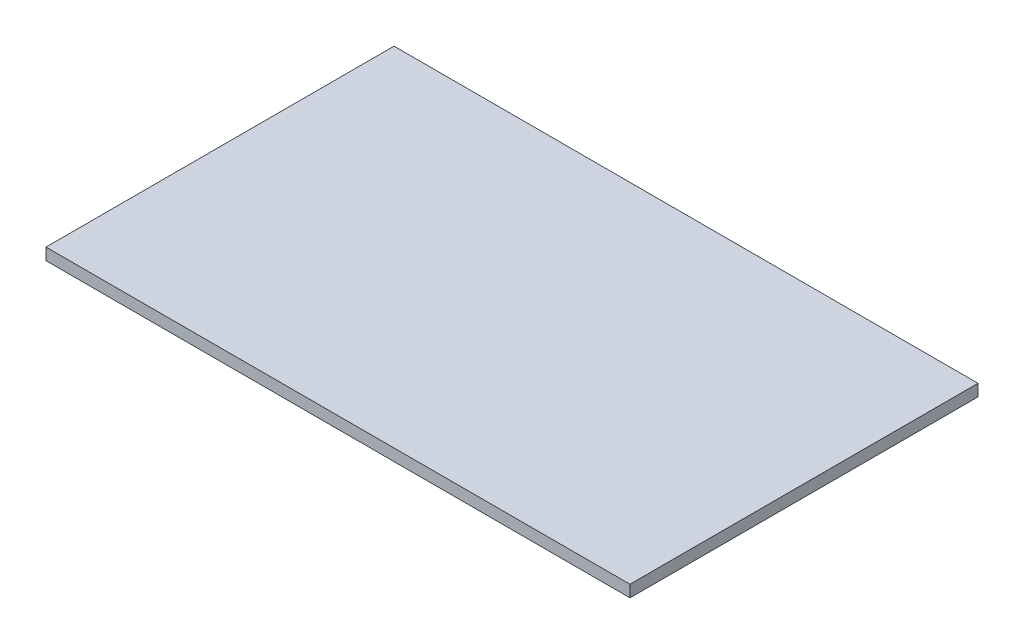
ISO-10303-21;
HEADER;
FILE_DESCRIPTION(('STEP AP214'),'2;1');
FILE_NAME('part.step','',(''),(''),'','','');
FILE_SCHEMA(('AUTOMOTIVE_DESIGN { 1 0 10303 214 1 1 1 1 }'));
ENDSEC;
DATA;
#1=APPLICATION_CONTEXT('core data for automotive mechanical design processes');
#2=APPLICATION_PROTOCOL_DEFINITION('international standard','automotive_design',2000,#1);
#3=PRODUCT_CONTEXT('',#1,'mechanical');
#4=PRODUCT('Part','Part','',(#3));
#5=PRODUCT_RELATED_PRODUCT_CATEGORY('part','',(#4));
#6=PRODUCT_DEFINITION_FORMATION('','',#4);
#7=PRODUCT_DEFINITION_CONTEXT('part definition',#1,'design');
#8=PRODUCT_DEFINITION('design','',#6,#7);
#9=PRODUCT_DEFINITION_SHAPE('','',#8);
#10=(LENGTH_UNIT() NAMED_UNIT(*) SI_UNIT(.MILLI.,.METRE.));
#11=(NAMED_UNIT(*) PLANE_ANGLE_UNIT() SI_UNIT($,.RADIAN.));
#12=(NAMED_UNIT(*) SI_UNIT($,.STERADIAN.) SOLID_ANGLE_UNIT());
#13=UNCERTAINTY_MEASURE_WITH_UNIT(LENGTH_MEASURE(1.E-05),#10,'distance_accuracy_value','');
#14=(GEOMETRIC_REPRESENTATION_CONTEXT(3) GLOBAL_UNCERTAINTY_ASSIGNED_CONTEXT((#13)) GLOBAL_UNIT_ASSIGNED_CONTEXT((#10,
#11,#12)) REPRESENTATION_CONTEXT('',''));
#15=CARTESIAN_POINT('',(0.,0.,0.));
#16=DIRECTION('',(0.,0.,1.));
#17=DIRECTION('',(1.,0.,0.));
#18=AXIS2_PLACEMENT_3D('',#15,#16,#17);
#19=CARTESIAN_POINT('',(247.5,10.,-147.5));
#20=DIRECTION('',(-1.,0.,0.));
#21=DIRECTION('',(0.,0.,1.));
#22=AXIS2_PLACEMENT_3D('',#19,#20,#21);
#23=PLANE('',#22);
#24=DIRECTION('',(0.,0.,-1.));
#25=VECTOR('',#24,1.);
#26=CARTESIAN_POINT('',(247.5,0.,-147.5));
#27=LINE('',#26,#25);
#28=CARTESIAN_POINT('',(247.5,0.,147.5));
#29=VERTEX_POINT('',#28);
#30=CARTESIAN_POINT('',(247.5,0.,-147.5));
#31=VERTEX_POINT('',#30);
#32=EDGE_CURVE('E95',#29,#31,#27,.T.);
#33=ORIENTED_EDGE('',*,*,#32,.T.);
#34=DIRECTION('',(0.,-1.,0.));
#35=VECTOR('',#34,1.);
#36=CARTESIAN_POINT('',(247.5,10.,-147.5));
#37=LINE('',#36,#35);
#38=CARTESIAN_POINT('',(247.5,10.,-147.5));
#39=VERTEX_POINT('',#38);
#40=EDGE_CURVE('E11',#39,#31,#37,.T.);
#41=ORIENTED_EDGE('',*,*,#40,.F.);
#42=DIRECTION('',(0.,0.,-1.));
#43=VECTOR('',#42,1.);
#44=CARTESIAN_POINT('',(247.5,10.,-147.5));
#45=LINE('',#44,#43);
#46=CARTESIAN_POINT('',(247.5,10.,147.5));
#47=VERTEX_POINT('',#46);
#48=EDGE_CURVE('E83',#47,#39,#45,.T.);
#49=ORIENTED_EDGE('',*,*,#48,.F.);
#50=DIRECTION('',(0.,-1.,0.));
#51=VECTOR('',#50,1.);
#52=CARTESIAN_POINT('',(247.5,10.,147.5));
#53=LINE('',#52,#51);
#54=EDGE_CURVE('E91',#47,#29,#53,.T.);
#55=ORIENTED_EDGE('',*,*,#54,.T.);
#56=EDGE_LOOP('',(#33,#41,#49,#55));
#57=FACE_BOUND('',#56,.T.);
#58=ADVANCED_FACE('F32',(#57),#23,.F.);
#59=CARTESIAN_POINT('',(-247.5,10.,-147.5));
#60=DIRECTION('',(0.,0.,1.));
#61=DIRECTION('',(1.,0.,0.));
#62=AXIS2_PLACEMENT_3D('',#59,#60,#61);
#63=PLANE('',#62);
#64=DIRECTION('',(-1.,0.,0.));
#65=VECTOR('',#64,1.);
#66=CARTESIAN_POINT('',(-247.5,0.,-147.5));
#67=LINE('',#66,#65);
#68=CARTESIAN_POINT('',(-247.5,0.,-147.5));
#69=VERTEX_POINT('',#68);
#70=EDGE_CURVE('E87',#31,#69,#67,.T.);
#71=ORIENTED_EDGE('',*,*,#70,.T.);
#72=DIRECTION('',(0.,-1.,0.));
#73=VECTOR('',#72,1.);
#74=CARTESIAN_POINT('',(-247.5,10.,-147.5));
#75=LINE('',#74,#73);
#76=CARTESIAN_POINT('',(-247.5,10.,-147.5));
#77=VERTEX_POINT('',#76);
#78=EDGE_CURVE('E40',#77,#69,#75,.T.);
#79=ORIENTED_EDGE('',*,*,#78,.F.);
#80=DIRECTION('',(-1.,0.,0.));
#81=VECTOR('',#80,1.);
#82=CARTESIAN_POINT('',(-247.5,10.,-147.5));
#83=LINE('',#82,#81);
#84=EDGE_CURVE('E78',#39,#77,#83,.T.);
#85=ORIENTED_EDGE('',*,*,#84,.F.);
#86=ORIENTED_EDGE('',*,*,#40,.T.);
#87=EDGE_LOOP('',(#71,#79,#85,#86));
#88=FACE_BOUND('',#87,.T.);
#89=ADVANCED_FACE('F86',(#88),#63,.F.);
#90=CARTESIAN_POINT('',(-247.5,10.,-147.5));
#91=DIRECTION('',(1.,0.,0.));
#92=DIRECTION('',(0.,0.,-1.));
#93=AXIS2_PLACEMENT_3D('',#90,#91,#92);
#94=PLANE('',#93);
#95=DIRECTION('',(0.,0.,1.));
#96=VECTOR('',#95,1.);
#97=CARTESIAN_POINT('',(-247.5,0.,-147.5));
#98=LINE('',#97,#96);
#99=CARTESIAN_POINT('',(-247.5,0.,147.5));
#100=VERTEX_POINT('',#99);
#101=EDGE_CURVE('E65',#69,#100,#98,.T.);
#102=ORIENTED_EDGE('',*,*,#101,.T.);
#103=DIRECTION('',(0.,-1.,0.));
#104=VECTOR('',#103,1.);
#105=CARTESIAN_POINT('',(-247.5,10.,147.5));
#106=LINE('',#105,#104);
#107=CARTESIAN_POINT('',(-247.5,10.,147.5));
#108=VERTEX_POINT('',#107);
#109=EDGE_CURVE('E88',#108,#100,#106,.T.);
#110=ORIENTED_EDGE('',*,*,#109,.F.);
#111=DIRECTION('',(0.,0.,1.));
#112=VECTOR('',#111,1.);
#113=CARTESIAN_POINT('',(-247.5,10.,-147.5));
#114=LINE('',#113,#112);
#115=EDGE_CURVE('E81',#77,#108,#114,.T.);
#116=ORIENTED_EDGE('',*,*,#115,.F.);
#117=ORIENTED_EDGE('',*,*,#78,.T.);
#118=EDGE_LOOP('',(#102,#110,#116,#117));
#119=FACE_BOUND('',#118,.T.);
#120=ADVANCED_FACE('F89',(#119),#94,.F.);
#121=CARTESIAN_POINT('',(-247.5,10.,147.5));
#122=DIRECTION('',(0.,0.,-1.));
#123=DIRECTION('',(-1.,0.,0.));
#124=AXIS2_PLACEMENT_3D('',#121,#122,#123);
#125=PLANE('',#124);
#126=DIRECTION('',(1.,0.,0.));
#127=VECTOR('',#126,1.);
#128=CARTESIAN_POINT('',(-247.5,0.,147.5));
#129=LINE('',#128,#127);
#130=EDGE_CURVE('E71',#100,#29,#129,.T.);
#131=ORIENTED_EDGE('',*,*,#130,.T.);
#132=ORIENTED_EDGE('',*,*,#54,.F.);
#133=DIRECTION('',(1.,0.,0.));
#134=VECTOR('',#133,1.);
#135=CARTESIAN_POINT('',(-247.5,10.,147.5));
#136=LINE('',#135,#134);
#137=EDGE_CURVE('E48',#108,#47,#136,.T.);
#138=ORIENTED_EDGE('',*,*,#137,.F.);
#139=ORIENTED_EDGE('',*,*,#109,.T.);
#140=EDGE_LOOP('',(#131,#132,#138,#139));
#141=FACE_BOUND('',#140,.T.);
#142=ADVANCED_FACE('F102',(#141),#125,.F.);
#143=CARTESIAN_POINT('',(0.,10.,0.));
#144=DIRECTION('',(0.,1.,0.));
#145=DIRECTION('',(0.,0.,1.));
#146=AXIS2_PLACEMENT_3D('',#143,#144,#145);
#147=PLANE('',#146);
#148=ORIENTED_EDGE('',*,*,#48,.T.);
#149=ORIENTED_EDGE('',*,*,#84,.T.);
#150=ORIENTED_EDGE('',*,*,#115,.T.);
#151=ORIENTED_EDGE('',*,*,#137,.T.);
#152=EDGE_LOOP('',(#148,#149,#150,#151));
#153=FACE_BOUND('',#152,.T.);
#154=ADVANCED_FACE('F79',(#153),#147,.T.);
#155=CARTESIAN_POINT('',(0.,0.,0.));
#156=DIRECTION('',(0.,1.,0.));
#157=DIRECTION('',(0.,0.,1.));
#158=AXIS2_PLACEMENT_3D('',#155,#156,#157);
#159=PLANE('',#158);
#160=ORIENTED_EDGE('',*,*,#32,.F.);
#161=ORIENTED_EDGE('',*,*,#130,.F.);
#162=ORIENTED_EDGE('',*,*,#101,.F.);
#163=ORIENTED_EDGE('',*,*,#70,.F.);
#164=EDGE_LOOP('',(#160,#161,#162,#163));
#165=FACE_BOUND('',#164,.T.);
#166=ADVANCED_FACE('F105',(#165),#159,.F.);
#167=CLOSED_SHELL('',(#58,#89,#120,#142,#154,#166));
#168=MANIFOLD_SOLID_BREP('B2',#167);
#169=ADVANCED_BREP_SHAPE_REPRESENTATION('',(#18,#168),#14);
#170=SHAPE_DEFINITION_REPRESENTATION(#9,#169);
ENDSEC;
END-ISO-10303-21;
